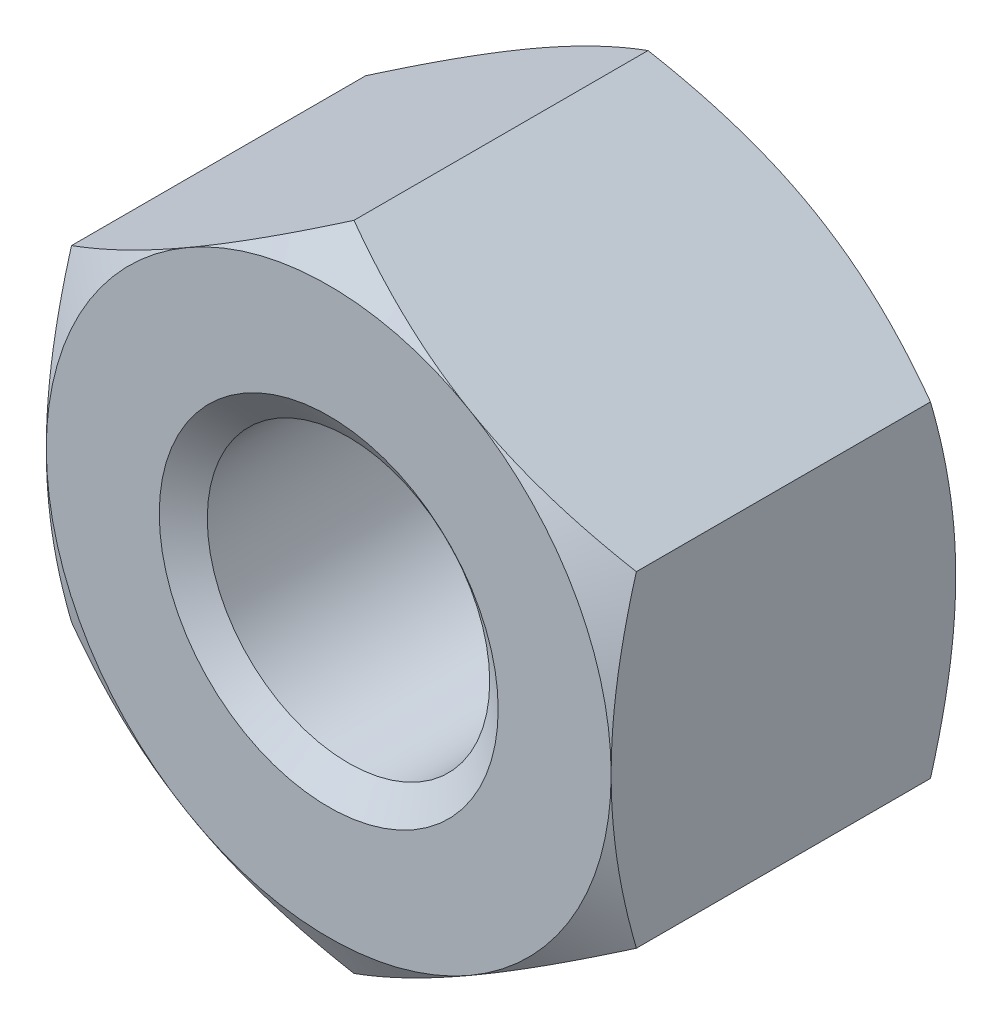
ISO-10303-21;
HEADER;
FILE_DESCRIPTION(('STEP AP214'),'2;1');
FILE_NAME('part.step','',(''),(''),'','','');
FILE_SCHEMA(('AUTOMOTIVE_DESIGN { 1 0 10303 214 1 1 1 1 }'));
ENDSEC;
DATA;
#1=APPLICATION_CONTEXT('core data for automotive mechanical design processes');
#2=APPLICATION_PROTOCOL_DEFINITION('international standard','automotive_design',2000,#1);
#3=PRODUCT_CONTEXT('',#1,'mechanical');
#4=PRODUCT('Part','Part','',(#3));
#5=PRODUCT_RELATED_PRODUCT_CATEGORY('part','',(#4));
#6=PRODUCT_DEFINITION_FORMATION('','',#4);
#7=PRODUCT_DEFINITION_CONTEXT('part definition',#1,'design');
#8=PRODUCT_DEFINITION('design','',#6,#7);
#9=PRODUCT_DEFINITION_SHAPE('','',#8);
#10=(LENGTH_UNIT() NAMED_UNIT(*) SI_UNIT(.MILLI.,.METRE.));
#11=(NAMED_UNIT(*) PLANE_ANGLE_UNIT() SI_UNIT($,.RADIAN.));
#12=(NAMED_UNIT(*) SI_UNIT($,.STERADIAN.) SOLID_ANGLE_UNIT());
#13=UNCERTAINTY_MEASURE_WITH_UNIT(LENGTH_MEASURE(1.E-05),#10,'distance_accuracy_value','');
#14=(GEOMETRIC_REPRESENTATION_CONTEXT(3) GLOBAL_UNCERTAINTY_ASSIGNED_CONTEXT((#13)) GLOBAL_UNIT_ASSIGNED_CONTEXT((#10,
#11,#12)) REPRESENTATION_CONTEXT('',''));
#15=CARTESIAN_POINT('',(0.,0.,0.));
#16=DIRECTION('',(0.,0.,1.));
#17=DIRECTION('',(1.,0.,0.));
#18=AXIS2_PLACEMENT_3D('',#15,#16,#17);
#19=CARTESIAN_POINT('',(0.,0.,-6.1));
#20=DIRECTION('',(0.,0.,1.));
#21=DIRECTION('',(1.,0.,0.));
#22=AXIS2_PLACEMENT_3D('',#19,#20,#21);
#23=CYLINDRICAL_SURFACE('',#22,2.5);
#24=CARTESIAN_POINT('',(0.,0.,-0.350103769104856));
#25=DIRECTION('',(0.,0.,1.));
#26=DIRECTION('',(1.,0.,0.));
#27=AXIS2_PLACEMENT_3D('',#24,#25,#26);
#28=CIRCLE('',#27,2.5);
#29=CARTESIAN_POINT('',(2.5,0.,-0.350103769104856));
#30=VERTEX_POINT('',#29);
#31=EDGE_CURVE('E181',#30,#30,#28,.F.);
#32=ORIENTED_EDGE('',*,*,#31,.F.);
#33=EDGE_LOOP('',(#32));
#34=FACE_BOUND('',#33,.T.);
#35=CARTESIAN_POINT('',(0.,0.,-5.72449623089514));
#36=DIRECTION('',(0.,0.,-1.));
#37=DIRECTION('',(-1.,0.,0.));
#38=AXIS2_PLACEMENT_3D('',#35,#36,#37);
#39=CIRCLE('',#38,2.5);
#40=CARTESIAN_POINT('',(-2.5,0.,-5.72449623089514));
#41=VERTEX_POINT('',#40);
#42=EDGE_CURVE('E46',#41,#41,#39,.F.);
#43=ORIENTED_EDGE('',*,*,#42,.F.);
#44=EDGE_LOOP('',(#43));
#45=FACE_BOUND('',#44,.T.);
#46=ADVANCED_FACE('F41',(#34,#45),#23,.F.);
#47=CARTESIAN_POINT('',(0.,5.77350269189626,-6.1));
#48=DIRECTION('',(-0.500000000000001,0.866025403784438,0.));
#49=DIRECTION('',(-0.866025403784438,-0.500000000000001,0.));
#50=AXIS2_PLACEMENT_3D('',#47,#48,#49);
#51=PLANE('',#50);
#52=DIRECTION('',(0.,0.,1.));
#53=VECTOR('',#52,1.);
#54=CARTESIAN_POINT('',(-5.,2.88675134594813,-6.1));
#55=LINE('',#54,#53);
#56=CARTESIAN_POINT('',(-5.,2.88675134594813,-5.65341801261479));
#57=VERTEX_POINT('',#56);
#58=CARTESIAN_POINT('',(-5.,2.88675134594813,-0.446581987385205));
#59=VERTEX_POINT('',#58);
#60=EDGE_CURVE('E171',#57,#59,#55,.T.);
#61=ORIENTED_EDGE('',*,*,#60,.T.);
#62=CARTESIAN_POINT('',(-5.0002,2.88663587589429,-0.446648656051831));
#63=CARTESIAN_POINT('',(-4.78046540547482,3.01349970319368,-0.373386567637637));
#64=CARTESIAN_POINT('',(-4.55885141554042,3.14144859993849,-0.306751321918093));
#65=CARTESIAN_POINT('',(-4.11178600454649,3.39956193532121,-0.190438991010811));
#66=CARTESIAN_POINT('',(-3.88632664040923,3.52973095989718,-0.140803049915789));
#67=CARTESIAN_POINT('',(-3.43816769477649,3.78847564779798,-0.0635510254186975));
#68=CARTESIAN_POINT('',(-3.21553790689581,3.91701101576052,-0.0354203782834889));
#69=CARTESIAN_POINT('',(-2.88081009815336,4.11026620624322,-0.010194921953684));
#70=CARTESIAN_POINT('',(-2.76915780319494,4.17472868879311,-0.00461345976948354));
#71=CARTESIAN_POINT('',(-2.5457500293262,4.30371322717528,0.000797783248529927));
#72=CARTESIAN_POINT('',(-2.43399455370968,4.36823528110589,0.000627741741796515));
#73=CARTESIAN_POINT('',(-2.12781576914936,4.54500768479195,-0.00775363179203703));
#74=CARTESIAN_POINT('',(-1.93349391403278,4.65719946015293,-0.021829771897252));
#75=CARTESIAN_POINT('',(-1.54613989800229,4.88083840557981,-0.0664652571094318));
#76=CARTESIAN_POINT('',(-1.35310909862843,4.9922847895602,-0.0970398601475098));
#77=CARTESIAN_POINT('',(-0.964974657525144,5.21637431361295,-0.173468493621166));
#78=CARTESIAN_POINT('',(-0.769920001358262,5.32898917185759,-0.219646378878683));
#79=CARTESIAN_POINT('',(-0.38271965464123,5.55253939626498,-0.324451794491938));
#80=CARTESIAN_POINT('',(-0.190569004591912,5.66347762579592,-0.383054703437378));
#81=CARTESIAN_POINT('',(0.000200000000000939,5.7736181619501,-0.446648656051834));
#82=B_SPLINE_CURVE_WITH_KNOTS('',3,(#62,#63,#64,#65,#66,#67,#68,#69,#70,#71,#72,#73,#74,#75,#76,
#77,#78,#79,#80,#81),.UNSPECIFIED.,.F.,.F.,(4,2,2,2,2,2,2,2,2,4),(0.,0.792555841363091,
1.58701660053334,2.36181537487281,2.74884076077326,3.13585419177295,3.8096236259968,
4.4840172390119,5.17336882348929,5.86136694793726),.UNSPECIFIED.);
#83=CARTESIAN_POINT('',(-2.5,4.33012701892219,0.));
#84=VERTEX_POINT('',#83);
#85=EDGE_CURVE('E140',#59,#84,#82,.T.);
#86=ORIENTED_EDGE('',*,*,#85,.T.);
#87=CARTESIAN_POINT('',(0.,5.77350269189626,-0.446581987385207));
#88=VERTEX_POINT('',#87);
#89=EDGE_CURVE('E60',#84,#88,#82,.T.);
#90=ORIENTED_EDGE('',*,*,#89,.T.);
#91=DIRECTION('',(0.,0.,1.));
#92=VECTOR('',#91,1.);
#93=CARTESIAN_POINT('',(0.,5.77350269189626,-6.1));
#94=LINE('',#93,#92);
#95=CARTESIAN_POINT('',(0.,5.77350269189626,-5.65341801261479));
#96=VERTEX_POINT('',#95);
#97=EDGE_CURVE('E156',#96,#88,#94,.T.);
#98=ORIENTED_EDGE('',*,*,#97,.F.);
#99=CARTESIAN_POINT('',(-5.0002,2.88663587589429,-5.65335134394817));
#100=CARTESIAN_POINT('',(-4.78046540547481,3.01349970319368,-5.72661343236236));
#101=CARTESIAN_POINT('',(-4.55885141554042,3.14144859993849,-5.79324867808191));
#102=CARTESIAN_POINT('',(-4.11178600454649,3.39956193532121,-5.90956100898919));
#103=CARTESIAN_POINT('',(-3.88632664040923,3.52973095989718,-5.95919695008421));
#104=CARTESIAN_POINT('',(-3.43816769477649,3.78847564779798,-6.0364489745813));
#105=CARTESIAN_POINT('',(-3.21553790689581,3.91701101576052,-6.06457962171651));
#106=CARTESIAN_POINT('',(-2.88081009815336,4.11026620624322,-6.08980507804632));
#107=CARTESIAN_POINT('',(-2.76915780319494,4.17472868879311,-6.09538654023052));
#108=CARTESIAN_POINT('',(-2.5457500293262,4.30371322717528,-6.10079778324853));
#109=CARTESIAN_POINT('',(-2.43399455370968,4.36823528110589,-6.1006277417418));
#110=CARTESIAN_POINT('',(-2.12781576914936,4.54500768479195,-6.09224636820796));
#111=CARTESIAN_POINT('',(-1.93349391403278,4.65719946015293,-6.07817022810275));
#112=CARTESIAN_POINT('',(-1.54613989800229,4.88083840557981,-6.03353474289057));
#113=CARTESIAN_POINT('',(-1.35310909862843,4.9922847895602,-6.00296013985249));
#114=CARTESIAN_POINT('',(-0.964974657525143,5.21637431361295,-5.92653150637883));
#115=CARTESIAN_POINT('',(-0.769920001358262,5.32898917185759,-5.88035362112132));
#116=CARTESIAN_POINT('',(-0.38271965464123,5.55253939626498,-5.77554820550806));
#117=CARTESIAN_POINT('',(-0.190569004591912,5.66347762579592,-5.71694529656262));
#118=CARTESIAN_POINT('',(0.000200000000000954,5.7736181619501,-5.65335134394817));
#119=B_SPLINE_CURVE_WITH_KNOTS('',3,(#99,#100,#101,#102,#103,#104,#105,#106,#107,#108,#109,#110,
#111,#112,#113,#114,#115,#116,#117,#118),.UNSPECIFIED.,.F.,.F.,(4,2,2,2,2,2,2,2,2,4),(0.,
0.792555841363092,1.58701660053334,2.36181537487281,2.74884076077326,3.13585419177295,
3.8096236259968,4.4840172390119,5.17336882348929,5.86136694793726),.UNSPECIFIED.);
#120=CARTESIAN_POINT('',(-2.5,4.33012701892219,-6.1));
#121=VERTEX_POINT('',#120);
#122=EDGE_CURVE('E174',#121,#96,#119,.T.);
#123=ORIENTED_EDGE('',*,*,#122,.F.);
#124=EDGE_CURVE('E273',#57,#121,#119,.T.);
#125=ORIENTED_EDGE('',*,*,#124,.F.);
#126=EDGE_LOOP('',(#61,#86,#90,#98,#123,#125));
#127=FACE_BOUND('',#126,.T.);
#128=ADVANCED_FACE('F43',(#127),#51,.T.);
#129=CARTESIAN_POINT('',(5.,2.88675134594812,-6.1));
#130=DIRECTION('',(0.500000000000001,0.866025403784438,0.));
#131=DIRECTION('',(-0.866025403784438,0.500000000000001,0.));
#132=AXIS2_PLACEMENT_3D('',#129,#130,#131);
#133=PLANE('',#132);
#134=ORIENTED_EDGE('',*,*,#97,.T.);
#135=CARTESIAN_POINT('',(-0.000199999999998966,5.7736181619501,-0.446648656051833));
#136=CARTESIAN_POINT('',(0.219534594525186,5.64675433465071,-0.373386567637639));
#137=CARTESIAN_POINT('',(0.441148584459582,5.5188054379059,-0.306751321918095));
#138=CARTESIAN_POINT('',(0.888213995453515,5.26069210252318,-0.190438991010812));
#139=CARTESIAN_POINT('',(1.11367335959078,5.13052307794721,-0.14080304991579));
#140=CARTESIAN_POINT('',(1.56183230522351,4.87177839004641,-0.0635510254186981));
#141=CARTESIAN_POINT('',(1.7844620931042,4.74324302208387,-0.0354203782834892));
#142=CARTESIAN_POINT('',(2.11918990184664,4.54998783160116,-0.0101949219536839));
#143=CARTESIAN_POINT('',(2.23084219680506,4.48552534905128,-0.00461345976948323));
#144=CARTESIAN_POINT('',(2.4542499706738,4.35654081066911,0.000797783248530617));
#145=CARTESIAN_POINT('',(2.56600544629032,4.2920187567385,0.000627741741797445));
#146=CARTESIAN_POINT('',(2.87218423085064,4.11524635305244,-0.0077536317920359));
#147=CARTESIAN_POINT('',(3.06650608596722,4.00305457769146,-0.0218297718972512));
#148=CARTESIAN_POINT('',(3.45386010199771,3.77941563226457,-0.066465257109431));
#149=CARTESIAN_POINT('',(3.64689090137157,3.66796924828418,-0.0970398601475084));
#150=CARTESIAN_POINT('',(4.03502534247485,3.44387972423143,-0.173468493621164));
#151=CARTESIAN_POINT('',(4.23007999864174,3.3312648659868,-0.219646378878681));
#152=CARTESIAN_POINT('',(4.61728034535877,3.1077146415794,-0.324451794491935));
#153=CARTESIAN_POINT('',(4.80943099540809,2.99677641204847,-0.383054703437375));
#154=CARTESIAN_POINT('',(5.0002,2.88663587589429,-0.446648656051831));
#155=B_SPLINE_CURVE_WITH_KNOTS('',3,(#135,#136,#137,#138,#139,#140,#141,#142,#143,#144,#145,
#146,#147,#148,#149,#150,#151,#152,#153,#154),.UNSPECIFIED.,.F.,.F.,(4,2,2,2,2,2,2,2,2,4),(0.,
0.792555841363092,1.58701660053334,2.36181537487281,2.74884076077326,3.13585419177295,
3.8096236259968,4.4840172390119,5.17336882348929,5.86136694793726),.UNSPECIFIED.);
#156=CARTESIAN_POINT('',(2.50000000000001,4.33012701892219,0.));
#157=VERTEX_POINT('',#156);
#158=EDGE_CURVE('E150',#88,#157,#155,.T.);
#159=ORIENTED_EDGE('',*,*,#158,.T.);
#160=CARTESIAN_POINT('',(5.,2.88675134594813,-0.446581987385207));
#161=VERTEX_POINT('',#160);
#162=EDGE_CURVE('E67',#157,#161,#155,.T.);
#163=ORIENTED_EDGE('',*,*,#162,.T.);
#164=DIRECTION('',(0.,0.,1.));
#165=VECTOR('',#164,1.);
#166=CARTESIAN_POINT('',(5.,2.88675134594812,-6.1));
#167=LINE('',#166,#165);
#168=CARTESIAN_POINT('',(5.,2.88675134594813,-5.65341801261479));
#169=VERTEX_POINT('',#168);
#170=EDGE_CURVE('E149',#169,#161,#167,.T.);
#171=ORIENTED_EDGE('',*,*,#170,.F.);
#172=CARTESIAN_POINT('',(-0.000199999999998966,5.7736181619501,-5.65335134394817));
#173=CARTESIAN_POINT('',(0.219534594525186,5.64675433465071,-5.72661343236236));
#174=CARTESIAN_POINT('',(0.441148584459582,5.5188054379059,-5.7932486780819));
#175=CARTESIAN_POINT('',(0.888213995453515,5.26069210252318,-5.90956100898919));
#176=CARTESIAN_POINT('',(1.11367335959078,5.13052307794721,-5.95919695008421));
#177=CARTESIAN_POINT('',(1.56183230522351,4.87177839004641,-6.0364489745813));
#178=CARTESIAN_POINT('',(1.7844620931042,4.74324302208387,-6.06457962171651));
#179=CARTESIAN_POINT('',(2.11918990184665,4.54998783160116,-6.08980507804632));
#180=CARTESIAN_POINT('',(2.23084219680506,4.48552534905128,-6.09538654023052));
#181=CARTESIAN_POINT('',(2.4542499706738,4.35654081066911,-6.10079778324853));
#182=CARTESIAN_POINT('',(2.56600544629032,4.2920187567385,-6.1006277417418));
#183=CARTESIAN_POINT('',(2.87218423085064,4.11524635305244,-6.09224636820796));
#184=CARTESIAN_POINT('',(3.06650608596722,4.00305457769146,-6.07817022810275));
#185=CARTESIAN_POINT('',(3.45386010199771,3.77941563226457,-6.03353474289057));
#186=CARTESIAN_POINT('',(3.64689090137157,3.66796924828418,-6.00296013985249));
#187=CARTESIAN_POINT('',(4.03502534247486,3.44387972423143,-5.92653150637884));
#188=CARTESIAN_POINT('',(4.23007999864174,3.3312648659868,-5.88035362112132));
#189=CARTESIAN_POINT('',(4.61728034535877,3.1077146415794,-5.77554820550806));
#190=CARTESIAN_POINT('',(4.80943099540809,2.99677641204846,-5.71694529656262));
#191=CARTESIAN_POINT('',(5.0002,2.88663587589429,-5.65335134394817));
#192=B_SPLINE_CURVE_WITH_KNOTS('',3,(#172,#173,#174,#175,#176,#177,#178,#179,#180,#181,#182,
#183,#184,#185,#186,#187,#188,#189,#190,#191),.UNSPECIFIED.,.F.,.F.,(4,2,2,2,2,2,2,2,2,4),(0.,
0.792555841363092,1.58701660053334,2.36181537487281,2.74884076077326,3.13585419177296,
3.8096236259968,4.4840172390119,5.17336882348929,5.86136694793726),.UNSPECIFIED.);
#193=CARTESIAN_POINT('',(2.50000000000001,4.33012701892219,-6.1));
#194=VERTEX_POINT('',#193);
#195=EDGE_CURVE('E266',#194,#169,#192,.T.);
#196=ORIENTED_EDGE('',*,*,#195,.F.);
#197=EDGE_CURVE('E272',#96,#194,#192,.T.);
#198=ORIENTED_EDGE('',*,*,#197,.F.);
#199=EDGE_LOOP('',(#134,#159,#163,#171,#196,#198));
#200=FACE_BOUND('',#199,.T.);
#201=ADVANCED_FACE('F147',(#200),#133,.T.);
#202=CARTESIAN_POINT('',(5.,2.88675134594812,-6.1));
#203=DIRECTION('',(-1.,0.,0.));
#204=DIRECTION('',(0.,0.,1.));
#205=AXIS2_PLACEMENT_3D('',#202,#203,#204);
#206=PLANE('',#205);
#207=CARTESIAN_POINT('',(5.,-7.65608998744865,-2.39263352655081));
#208=CARTESIAN_POINT('',(5.,-7.43656171400167,-2.28654533817208));
#209=CARTESIAN_POINT('',(5.,-7.21651440170022,-2.18151175461596));
#210=CARTESIAN_POINT('',(5.,-6.77510105921519,-1.97415643363977));
#211=CARTESIAN_POINT('',(5.,-6.55373480873053,-1.87183516574569));
#212=CARTESIAN_POINT('',(5.,-6.10820714710357,-1.66996807853491));
#213=CARTESIAN_POINT('',(5.,-5.88403698971125,-1.57044149281731));
#214=CARTESIAN_POINT('',(5.,-5.43385418074677,-1.37566323278682));
#215=CARTESIAN_POINT('',(5.,-5.20784162594278,-1.28041133564243));
#216=CARTESIAN_POINT('',(5.,-4.75080884782756,-1.09418830918942));
#217=CARTESIAN_POINT('',(5.,-4.51976121099505,-1.0032840909987));
#218=CARTESIAN_POINT('',(5.,-4.054940534221,-0.828595302971952));
#219=CARTESIAN_POINT('',(5.,-3.82116719434025,-0.744811525247654));
#220=CARTESIAN_POINT('',(5.,-3.35100416711889,-0.586614632364621));
#221=CARTESIAN_POINT('',(5.,-3.11462125088188,-0.512181595225273));
#222=CARTESIAN_POINT('',(5.,-2.63849247870024,-0.375104393872378));
#223=CARTESIAN_POINT('',(5.,-2.3987477121033,-0.31245650159695));
#224=CARTESIAN_POINT('',(5.,-1.91574303714497,-0.20198775399487));
#225=CARTESIAN_POINT('',(5.,-1.672482210841,-0.154170846558642));
#226=CARTESIAN_POINT('',(5.,-1.18299359688664,-0.0765955557924027));
#227=CARTESIAN_POINT('',(5.,-0.936765806613283,-0.0468371884284092));
#228=CARTESIAN_POINT('',(5.,-0.567032279323849,-0.0176512015862963));
#229=CARTESIAN_POINT('',(5.,-0.444105297658541,-0.0104963190599468));
#230=CARTESIAN_POINT('',(5.,-0.198053005238566,-0.00139545226904067));
#231=CARTESIAN_POINT('',(5.,-0.0749276970802297,0.000550599639614622));
#232=CARTESIAN_POINT('',(5.,0.171257999892352,-0.000818470345664008));
#233=CARTESIAN_POINT('',(5.,0.294318397227087,-0.00413211431301164));
#234=CARTESIAN_POINT('',(5.,0.54019273078884,-0.0159365972827602));
#235=CARTESIAN_POINT('',(5.,0.663006654263483,-0.0244276975701652));
#236=CARTESIAN_POINT('',(5.,0.960681872881667,-0.0511063802753009));
#237=CARTESIAN_POINT('',(5.,1.1353143627994,-0.0718889676982862));
#238=CARTESIAN_POINT('',(5.,1.48321675799389,-0.122765655722695));
#239=CARTESIAN_POINT('',(5.,1.65648647841236,-0.152860997990034));
#240=CARTESIAN_POINT('',(5.,2.00155426058699,-0.221298792011552));
#241=CARTESIAN_POINT('',(5.,2.17335067370373,-0.259649477486405));
#242=CARTESIAN_POINT('',(5.,2.51518168221054,-0.343428305385011));
#243=CARTESIAN_POINT('',(5.,2.6852163841931,-0.388856016914002));
#244=CARTESIAN_POINT('',(5.,3.02770318928892,-0.486887782054292));
#245=CARTESIAN_POINT('',(5.,3.20011248435312,-0.539640363823942));
#246=CARTESIAN_POINT('',(5.,3.54310870430177,-0.650357787302627));
#247=CARTESIAN_POINT('',(5.,3.71369679659714,-0.70831903390707));
#248=CARTESIAN_POINT('',(5.,4.05236610267973,-0.828256540728474));
#249=CARTESIAN_POINT('',(5.,4.22045602230056,-0.890208365426365));
#250=CARTESIAN_POINT('',(5.,4.55533171687448,-1.01774823413812));
#251=CARTESIAN_POINT('',(5.,4.72211693321414,-1.08333774778777));
#252=CARTESIAN_POINT('',(5.,4.88829623733355,-1.15038625817724));
#253=B_SPLINE_CURVE_WITH_KNOTS('',3,(#207,#208,#209,#210,#211,#212,#213,#214,#215,#216,#217,
#218,#219,#220,#221,#222,#223,#224,#225,#226,#227,#228,#229,#230,#231,#232,#233,#234,#235,#236,
#237,#238,#239,#240,#241,#242,#243,#244,#245,#246,#247,#248,#249,#250,#251,#252),.UNSPECIFIED.,
.F.,.F.,(4,2,2,2,2,2,2,2,2,2,2,2,2,2,2,2,2,2,2,2,2,2,4),(0.,0.731464740665351,1.46305528824909,
2.19883243307486,2.93457117856034,3.67934251246858,4.42419659013362,5.1674358087199,
5.91043951739339,6.65364083834807,7.39684281638516,7.76615414335457,8.13546067426611,
8.50466345177857,8.87388486298453,9.40118542949728,9.92855633110016,10.4564556797854,
10.9843228991235,11.525120280828,12.065547221064,12.6029322754131,13.1405360390026),.UNSPECIFIED.);
#254=CARTESIAN_POINT('',(5.,-2.88675134594814,-0.446581987385207));
#255=VERTEX_POINT('',#254);
#256=CARTESIAN_POINT('',(5.,0.,0.));
#257=VERTEX_POINT('',#256);
#258=EDGE_CURVE('E142',#255,#257,#253,.T.);
#259=ORIENTED_EDGE('',*,*,#258,.F.);
#260=DIRECTION('',(0.,0.,1.));
#261=VECTOR('',#260,1.);
#262=CARTESIAN_POINT('',(5.,-2.88675134594814,-6.1));
#263=LINE('',#262,#261);
#264=CARTESIAN_POINT('',(5.,-2.88675134594814,-5.65341801261479));
#265=VERTEX_POINT('',#264);
#266=EDGE_CURVE('E157',#265,#255,#263,.T.);
#267=ORIENTED_EDGE('',*,*,#266,.F.);
#268=CARTESIAN_POINT('',(5.,-7.65608998744865,-3.70736647344919));
#269=CARTESIAN_POINT('',(5.,-7.43656171400166,-3.81345466182792));
#270=CARTESIAN_POINT('',(5.,-7.21651440170022,-3.91848824538404));
#271=CARTESIAN_POINT('',(5.,-6.77510105921519,-4.12584356636023));
#272=CARTESIAN_POINT('',(5.,-6.55373480873053,-4.22816483425431));
#273=CARTESIAN_POINT('',(5.,-6.10820714710357,-4.43003192146509));
#274=CARTESIAN_POINT('',(5.,-5.88403698971125,-4.52955850718269));
#275=CARTESIAN_POINT('',(5.,-5.43385418074678,-4.72433676721318));
#276=CARTESIAN_POINT('',(5.,-5.20784162594279,-4.81958866435756));
#277=CARTESIAN_POINT('',(5.,-4.75080884782756,-5.00581169081058));
#278=CARTESIAN_POINT('',(5.,-4.51976121099506,-5.0967159090013));
#279=CARTESIAN_POINT('',(5.,-4.054940534221,-5.27140469702805));
#280=CARTESIAN_POINT('',(5.,-3.82116719434025,-5.35518847475234));
#281=CARTESIAN_POINT('',(5.,-3.35100416711889,-5.51338536763538));
#282=CARTESIAN_POINT('',(5.,-3.11462125088188,-5.58781840477473));
#283=CARTESIAN_POINT('',(5.,-2.63849247870024,-5.72489560612762));
#284=CARTESIAN_POINT('',(5.,-2.3987477121033,-5.78754349840305));
#285=CARTESIAN_POINT('',(5.,-1.91574303714497,-5.89801224600513));
#286=CARTESIAN_POINT('',(5.,-1.672482210841,-5.94582915344136));
#287=CARTESIAN_POINT('',(5.,-1.18299359688664,-6.0234044442076));
#288=CARTESIAN_POINT('',(5.,-0.936765806613281,-6.05316281157159));
#289=CARTESIAN_POINT('',(5.,-0.567032279323847,-6.0823487984137));
#290=CARTESIAN_POINT('',(5.,-0.444105297658539,-6.08950368094005));
#291=CARTESIAN_POINT('',(5.,-0.198053005238565,-6.09860454773096));
#292=CARTESIAN_POINT('',(5.,-0.074927697080228,-6.10055059963961));
#293=CARTESIAN_POINT('',(5.,0.171257999892354,-6.09918152965434));
#294=CARTESIAN_POINT('',(5.,0.294318397227089,-6.09586788568699));
#295=CARTESIAN_POINT('',(5.,0.540192730788841,-6.08406340271724));
#296=CARTESIAN_POINT('',(5.,0.663006654263484,-6.07557230242984));
#297=CARTESIAN_POINT('',(5.,0.960681872881666,-6.0488936197247));
#298=CARTESIAN_POINT('',(5.,1.1353143627994,-6.02811103230171));
#299=CARTESIAN_POINT('',(5.,1.48321675799389,-5.97723434427731));
#300=CARTESIAN_POINT('',(5.,1.65648647841236,-5.94713900200997));
#301=CARTESIAN_POINT('',(5.,2.00155426058699,-5.87870120798845));
#302=CARTESIAN_POINT('',(5.,2.17335067370373,-5.84035052251359));
#303=CARTESIAN_POINT('',(5.,2.51518168221054,-5.75657169461499));
#304=CARTESIAN_POINT('',(5.,2.6852163841931,-5.711143983086));
#305=CARTESIAN_POINT('',(5.,3.02770318928891,-5.61311221794571));
#306=CARTESIAN_POINT('',(5.,3.20011248435311,-5.56035963617606));
#307=CARTESIAN_POINT('',(5.,3.54310870430176,-5.44964221269737));
#308=CARTESIAN_POINT('',(5.,3.71369679659714,-5.39168096609293));
#309=CARTESIAN_POINT('',(5.,4.05236610267973,-5.27174345927153));
#310=CARTESIAN_POINT('',(5.,4.22045602230055,-5.20979163457364));
#311=CARTESIAN_POINT('',(5.,4.55533171687448,-5.08225176586188));
#312=CARTESIAN_POINT('',(5.,4.72211693321414,-5.01666225221223));
#313=CARTESIAN_POINT('',(5.,4.88829623733355,-4.94961374182276));
#314=B_SPLINE_CURVE_WITH_KNOTS('',3,(#268,#269,#270,#271,#272,#273,#274,#275,#276,#277,#278,
#279,#280,#281,#282,#283,#284,#285,#286,#287,#288,#289,#290,#291,#292,#293,#294,#295,#296,#297,
#298,#299,#300,#301,#302,#303,#304,#305,#306,#307,#308,#309,#310,#311,#312,#313),.UNSPECIFIED.,
.F.,.F.,(4,2,2,2,2,2,2,2,2,2,2,2,2,2,2,2,2,2,2,2,2,2,4),(0.,0.731464740665352,1.46305528824909,
2.19883243307486,2.93457117856034,3.67934251246858,4.42419659013362,5.1674358087199,
5.91043951739339,6.65364083834807,7.39684281638517,7.76615414335457,8.13546067426611,
8.50466345177857,8.87388486298453,9.40118542949728,9.92855633110016,10.4564556797854,
10.9843228991235,11.525120280828,12.065547221064,12.6029322754131,13.1405360390026),.UNSPECIFIED.);
#315=CARTESIAN_POINT('',(5.,0.,-6.1));
#316=VERTEX_POINT('',#315);
#317=EDGE_CURVE('E280',#265,#316,#314,.T.);
#318=ORIENTED_EDGE('',*,*,#317,.T.);
#319=EDGE_CURVE('E155',#316,#169,#314,.T.);
#320=ORIENTED_EDGE('',*,*,#319,.T.);
#321=ORIENTED_EDGE('',*,*,#170,.T.);
#322=EDGE_CURVE('E132',#257,#161,#253,.T.);
#323=ORIENTED_EDGE('',*,*,#322,.F.);
#324=EDGE_LOOP('',(#259,#267,#318,#320,#321,#323));
#325=FACE_BOUND('',#324,.T.);
#326=ADVANCED_FACE('F153',(#325),#206,.F.);
#327=CARTESIAN_POINT('',(0.,-5.77350269189627,-6.1));
#328=DIRECTION('',(0.5,-0.866025403784438,0.));
#329=DIRECTION('',(0.866025403784438,0.500000000000001,0.));
#330=AXIS2_PLACEMENT_3D('',#327,#328,#329);
#331=PLANE('',#330);
#332=ORIENTED_EDGE('',*,*,#266,.T.);
#333=CARTESIAN_POINT('',(5.0002,-2.8866358758943,-0.446648656051834));
#334=CARTESIAN_POINT('',(4.78046540547481,-3.01349970319369,-0.37338656763764));
#335=CARTESIAN_POINT('',(4.55885141554042,-3.1414485999385,-0.306751321918096));
#336=CARTESIAN_POINT('',(4.11178600454648,-3.39956193532122,-0.190438991010814));
#337=CARTESIAN_POINT('',(3.88632664040922,-3.52973095989719,-0.140803049915792));
#338=CARTESIAN_POINT('',(3.43816769477649,-3.78847564779799,-0.0635510254187013));
#339=CARTESIAN_POINT('',(3.2155379068958,-3.91701101576053,-0.035420378283493));
#340=CARTESIAN_POINT('',(2.88081009815336,-4.11026620624324,-0.0101949219536883));
#341=CARTESIAN_POINT('',(2.76915780319494,-4.17472868879312,-0.00461345976948784));
#342=CARTESIAN_POINT('',(2.5457500293262,-4.30371322717529,0.000797783248525706));
#343=CARTESIAN_POINT('',(2.43399455370968,-4.3682352811059,0.000627741741792379));
#344=CARTESIAN_POINT('',(2.12781576914936,-4.54500768479195,-0.00775363179204149));
#345=CARTESIAN_POINT('',(1.93349391403278,-4.65719946015294,-0.0218297718972572));
#346=CARTESIAN_POINT('',(1.54613989800229,-4.88083840557983,-0.0664652571094375));
#347=CARTESIAN_POINT('',(1.35310909862843,-4.99228478956021,-0.097039860147515));
#348=CARTESIAN_POINT('',(0.964974657525142,-5.21637431361296,-0.173468493621171));
#349=CARTESIAN_POINT('',(0.769920001358261,-5.3289891718576,-0.219646378878688));
#350=CARTESIAN_POINT('',(0.38271965464123,-5.55253939626499,-0.324451794491943));
#351=CARTESIAN_POINT('',(0.190569004591913,-5.66347762579593,-0.383054703437384));
#352=CARTESIAN_POINT('',(-0.00020000000000063,-5.77361816195011,-0.446648656051839));
#353=B_SPLINE_CURVE_WITH_KNOTS('',3,(#333,#334,#335,#336,#337,#338,#339,#340,#341,#342,#343,
#344,#345,#346,#347,#348,#349,#350,#351,#352),.UNSPECIFIED.,.F.,.F.,(4,2,2,2,2,2,2,2,2,4),(0.,
0.792555841363093,1.58701660053334,2.36181537487281,2.74884076077326,3.13585419177296,
3.8096236259968,4.4840172390119,5.17336882348929,5.86136694793726),.UNSPECIFIED.);
#354=CARTESIAN_POINT('',(2.5,-4.33012701892219,0.));
#355=VERTEX_POINT('',#354);
#356=EDGE_CURVE('E378',#255,#355,#353,.T.);
#357=ORIENTED_EDGE('',*,*,#356,.T.);
#358=CARTESIAN_POINT('',(0.,-5.77350269189626,-0.446581987385207));
#359=VERTEX_POINT('',#358);
#360=EDGE_CURVE('E234',#355,#359,#353,.T.);
#361=ORIENTED_EDGE('',*,*,#360,.T.);
#362=DIRECTION('',(0.,0.,1.));
#363=VECTOR('',#362,1.);
#364=CARTESIAN_POINT('',(0.,-5.77350269189627,-6.1));
#365=LINE('',#364,#363);
#366=CARTESIAN_POINT('',(0.,-5.77350269189626,-5.65341801261479));
#367=VERTEX_POINT('',#366);
#368=EDGE_CURVE('E162',#367,#359,#365,.T.);
#369=ORIENTED_EDGE('',*,*,#368,.F.);
#370=CARTESIAN_POINT('',(5.0002,-2.8866358758943,-5.65335134394816));
#371=CARTESIAN_POINT('',(4.78046540547481,-3.01349970319369,-5.72661343236236));
#372=CARTESIAN_POINT('',(4.55885141554042,-3.1414485999385,-5.7932486780819));
#373=CARTESIAN_POINT('',(4.11178600454648,-3.39956193532122,-5.90956100898919));
#374=CARTESIAN_POINT('',(3.88632664040922,-3.52973095989719,-5.95919695008421));
#375=CARTESIAN_POINT('',(3.43816769477649,-3.78847564779799,-6.0364489745813));
#376=CARTESIAN_POINT('',(3.2155379068958,-3.91701101576053,-6.06457962171651));
#377=CARTESIAN_POINT('',(2.88081009815336,-4.11026620624324,-6.08980507804631));
#378=CARTESIAN_POINT('',(2.76915780319494,-4.17472868879312,-6.09538654023051));
#379=CARTESIAN_POINT('',(2.5457500293262,-4.30371322717529,-6.10079778324852));
#380=CARTESIAN_POINT('',(2.43399455370968,-4.3682352811059,-6.10062774174179));
#381=CARTESIAN_POINT('',(2.12781576914936,-4.54500768479195,-6.09224636820796));
#382=CARTESIAN_POINT('',(1.93349391403278,-4.65719946015294,-6.07817022810274));
#383=CARTESIAN_POINT('',(1.54613989800229,-4.88083840557983,-6.03353474289056));
#384=CARTESIAN_POINT('',(1.35310909862843,-4.99228478956021,-6.00296013985248));
#385=CARTESIAN_POINT('',(0.964974657525143,-5.21637431361296,-5.92653150637883));
#386=CARTESIAN_POINT('',(0.769920001358261,-5.3289891718576,-5.88035362112131));
#387=CARTESIAN_POINT('',(0.38271965464123,-5.55253939626499,-5.77554820550806));
#388=CARTESIAN_POINT('',(0.190569004591913,-5.66347762579593,-5.71694529656262));
#389=CARTESIAN_POINT('',(-0.000200000000000624,-5.77361816195011,-5.65335134394816));
#390=B_SPLINE_CURVE_WITH_KNOTS('',3,(#370,#371,#372,#373,#374,#375,#376,#377,#378,#379,#380,
#381,#382,#383,#384,#385,#386,#387,#388,#389),.UNSPECIFIED.,.F.,.F.,(4,2,2,2,2,2,2,2,2,4),(0.,
0.792555841363093,1.58701660053334,2.36181537487281,2.74884076077326,3.13585419177296,
3.8096236259968,4.4840172390119,5.17336882348929,5.86136694793726),.UNSPECIFIED.);
#391=CARTESIAN_POINT('',(2.5,-4.33012701892219,-6.1));
#392=VERTEX_POINT('',#391);
#393=EDGE_CURVE('E287',#392,#367,#390,.T.);
#394=ORIENTED_EDGE('',*,*,#393,.F.);
#395=EDGE_CURVE('E286',#265,#392,#390,.T.);
#396=ORIENTED_EDGE('',*,*,#395,.F.);
#397=EDGE_LOOP('',(#332,#357,#361,#369,#394,#396));
#398=FACE_BOUND('',#397,.T.);
#399=ADVANCED_FACE('F299',(#398),#331,.T.);
#400=CARTESIAN_POINT('',(-5.,-2.88675134594813,-6.1));
#401=DIRECTION('',(-0.500000000000001,-0.866025403784438,0.));
#402=DIRECTION('',(0.866025403784438,-0.500000000000001,0.));
#403=AXIS2_PLACEMENT_3D('',#400,#401,#402);
#404=PLANE('',#403);
#405=ORIENTED_EDGE('',*,*,#368,.T.);
#406=CARTESIAN_POINT('',(0.000199999999999249,-5.77361816195011,-0.446648656051839));
#407=CARTESIAN_POINT('',(-0.219534594525186,-5.64675433465072,-0.373386567637644));
#408=CARTESIAN_POINT('',(-0.441148584459582,-5.51880543790591,-0.3067513219181));
#409=CARTESIAN_POINT('',(-0.888213995453516,-5.26069210252319,-0.190438991010817));
#410=CARTESIAN_POINT('',(-1.11367335959078,-5.13052307794722,-0.140803049915795));
#411=CARTESIAN_POINT('',(-1.56183230522351,-4.87177839004642,-0.063551025418703));
#412=CARTESIAN_POINT('',(-1.7844620931042,-4.74324302208388,-0.0354203782834935));
#413=CARTESIAN_POINT('',(-2.11918990184665,-4.54998783160117,-0.0101949219536883));
#414=CARTESIAN_POINT('',(-2.23084219680507,-4.48552534905128,-0.00461345976948777));
#415=CARTESIAN_POINT('',(-2.4542499706738,-4.35654081066911,0.000797783248525878));
#416=CARTESIAN_POINT('',(-2.56600544629032,-4.2920187567385,0.000627741741792682));
#417=CARTESIAN_POINT('',(-2.87218423085065,-4.11524635305245,-0.00775363179204064));
#418=CARTESIAN_POINT('',(-3.06650608596722,-4.00305457769147,-0.0218297718972558));
#419=CARTESIAN_POINT('',(-3.45386010199771,-3.77941563226458,-0.066465257109435));
#420=CARTESIAN_POINT('',(-3.64689090137157,-3.66796924828419,-0.097039860147512));
#421=CARTESIAN_POINT('',(-4.03502534247486,-3.44387972423144,-0.173468493621168));
#422=CARTESIAN_POINT('',(-4.23007999864174,-3.3312648659868,-0.219646378878684));
#423=CARTESIAN_POINT('',(-4.61728034535877,-3.10771464157941,-0.324451794491939));
#424=CARTESIAN_POINT('',(-4.80943099540809,-2.99677641204847,-0.383054703437379));
#425=CARTESIAN_POINT('',(-5.0002,-2.8866358758943,-0.446648656051833));
#426=B_SPLINE_CURVE_WITH_KNOTS('',3,(#406,#407,#408,#409,#410,#411,#412,#413,#414,#415,#416,
#417,#418,#419,#420,#421,#422,#423,#424,#425),.UNSPECIFIED.,.F.,.F.,(4,2,2,2,2,2,2,2,2,4),(0.,
0.792555841363093,1.58701660053334,2.36181537487281,2.74884076077326,3.13585419177296,
3.8096236259968,4.4840172390119,5.17336882348929,5.86136694793726),.UNSPECIFIED.);
#427=CARTESIAN_POINT('',(-2.50000000000001,-4.33012701892219,0.));
#428=VERTEX_POINT('',#427);
#429=EDGE_CURVE('E375',#359,#428,#426,.T.);
#430=ORIENTED_EDGE('',*,*,#429,.T.);
#431=CARTESIAN_POINT('',(-5.,-2.88675134594813,-0.446581987385207));
#432=VERTEX_POINT('',#431);
#433=EDGE_CURVE('E207',#428,#432,#426,.T.);
#434=ORIENTED_EDGE('',*,*,#433,.T.);
#435=DIRECTION('',(0.,0.,1.));
#436=VECTOR('',#435,1.);
#437=CARTESIAN_POINT('',(-5.,-2.88675134594813,-6.1));
#438=LINE('',#437,#436);
#439=CARTESIAN_POINT('',(-5.,-2.88675134594813,-5.65341801261479));
#440=VERTEX_POINT('',#439);
#441=EDGE_CURVE('E168',#440,#432,#438,.T.);
#442=ORIENTED_EDGE('',*,*,#441,.F.);
#443=CARTESIAN_POINT('',(0.000199999999999249,-5.77361816195011,-5.65335134394816));
#444=CARTESIAN_POINT('',(-0.219534594525186,-5.64675433465072,-5.72661343236236));
#445=CARTESIAN_POINT('',(-0.441148584459582,-5.51880543790591,-5.7932486780819));
#446=CARTESIAN_POINT('',(-0.888213995453515,-5.26069210252319,-5.90956100898918));
#447=CARTESIAN_POINT('',(-1.11367335959078,-5.13052307794722,-5.9591969500842));
#448=CARTESIAN_POINT('',(-1.56183230522351,-4.87177839004642,-6.0364489745813));
#449=CARTESIAN_POINT('',(-1.7844620931042,-4.74324302208388,-6.06457962171651));
#450=CARTESIAN_POINT('',(-2.11918990184665,-4.54998783160117,-6.08980507804631));
#451=CARTESIAN_POINT('',(-2.23084219680507,-4.48552534905128,-6.09538654023051));
#452=CARTESIAN_POINT('',(-2.4542499706738,-4.35654081066911,-6.10079778324852));
#453=CARTESIAN_POINT('',(-2.56600544629032,-4.2920187567385,-6.10062774174179));
#454=CARTESIAN_POINT('',(-2.87218423085065,-4.11524635305245,-6.09224636820796));
#455=CARTESIAN_POINT('',(-3.06650608596722,-4.00305457769147,-6.07817022810274));
#456=CARTESIAN_POINT('',(-3.45386010199771,-3.77941563226458,-6.03353474289057));
#457=CARTESIAN_POINT('',(-3.64689090137157,-3.66796924828419,-6.00296013985249));
#458=CARTESIAN_POINT('',(-4.03502534247486,-3.44387972423144,-5.92653150637883));
#459=CARTESIAN_POINT('',(-4.23007999864174,-3.3312648659868,-5.88035362112132));
#460=CARTESIAN_POINT('',(-4.61728034535877,-3.10771464157941,-5.77554820550806));
#461=CARTESIAN_POINT('',(-4.80943099540809,-2.99677641204847,-5.71694529656262));
#462=CARTESIAN_POINT('',(-5.0002,-2.8866358758943,-5.65335134394817));
#463=B_SPLINE_CURVE_WITH_KNOTS('',3,(#443,#444,#445,#446,#447,#448,#449,#450,#451,#452,#453,
#454,#455,#456,#457,#458,#459,#460,#461,#462),.UNSPECIFIED.,.F.,.F.,(4,2,2,2,2,2,2,2,2,4),(0.,
0.792555841363093,1.58701660053334,2.36181537487281,2.74884076077326,3.13585419177296,
3.8096236259968,4.4840172390119,5.17336882348929,5.86136694793726),.UNSPECIFIED.);
#464=CARTESIAN_POINT('',(-2.50000000000001,-4.33012701892219,-6.1));
#465=VERTEX_POINT('',#464);
#466=EDGE_CURVE('E294',#465,#440,#463,.T.);
#467=ORIENTED_EDGE('',*,*,#466,.F.);
#468=EDGE_CURVE('E293',#367,#465,#463,.T.);
#469=ORIENTED_EDGE('',*,*,#468,.F.);
#470=EDGE_LOOP('',(#405,#430,#434,#442,#467,#469));
#471=FACE_BOUND('',#470,.T.);
#472=ADVANCED_FACE('F302',(#471),#404,.T.);
#473=CARTESIAN_POINT('',(-5.,2.88675134594813,-6.1));
#474=DIRECTION('',(-1.,0.,0.));
#475=DIRECTION('',(0.,0.,1.));
#476=AXIS2_PLACEMENT_3D('',#473,#474,#475);
#477=PLANE('',#476);
#478=ORIENTED_EDGE('',*,*,#441,.T.);
#479=CARTESIAN_POINT('',(-5.,-7.65608998744865,-2.3926335265508));
#480=CARTESIAN_POINT('',(-5.,-7.43656171400166,-2.28654533817208));
#481=CARTESIAN_POINT('',(-5.,-7.21651440170022,-2.18151175461596));
#482=CARTESIAN_POINT('',(-5.,-6.77510105921519,-1.97415643363977));
#483=CARTESIAN_POINT('',(-5.,-6.55373480873053,-1.87183516574569));
#484=CARTESIAN_POINT('',(-5.,-6.10820714710357,-1.66996807853491));
#485=CARTESIAN_POINT('',(-5.,-5.88403698971124,-1.57044149281731));
#486=CARTESIAN_POINT('',(-5.,-5.43385418074677,-1.37566323278682));
#487=CARTESIAN_POINT('',(-5.,-5.20784162594278,-1.28041133564243));
#488=CARTESIAN_POINT('',(-5.,-4.75080884782756,-1.09418830918942));
#489=CARTESIAN_POINT('',(-5.,-4.51976121099505,-1.0032840909987));
#490=CARTESIAN_POINT('',(-5.,-4.054940534221,-0.828595302971951));
#491=CARTESIAN_POINT('',(-5.,-3.82116719434025,-0.744811525247654));
#492=CARTESIAN_POINT('',(-5.,-3.35100416711889,-0.586614632364621));
#493=CARTESIAN_POINT('',(-5.,-3.11462125088188,-0.512181595225272));
#494=CARTESIAN_POINT('',(-5.,-2.63849247870023,-0.375104393872378));
#495=CARTESIAN_POINT('',(-5.,-2.3987477121033,-0.31245650159695));
#496=CARTESIAN_POINT('',(-5.,-1.91574303714497,-0.20198775399487));
#497=CARTESIAN_POINT('',(-5.,-1.672482210841,-0.154170846558642));
#498=CARTESIAN_POINT('',(-5.,-1.18299359688664,-0.0765955557924027));
#499=CARTESIAN_POINT('',(-5.,-0.93676580661328,-0.0468371884284092));
#500=CARTESIAN_POINT('',(-5.,-0.567032279323847,-0.0176512015862963));
#501=CARTESIAN_POINT('',(-5.,-0.444105297658538,-0.0104963190599468));
#502=CARTESIAN_POINT('',(-5.,-0.198053005238564,-0.00139545226904067));
#503=CARTESIAN_POINT('',(-5.,-0.0749276970802274,0.000550599639614625));
#504=CARTESIAN_POINT('',(-5.,0.171257999892354,-0.000818470345664012));
#505=CARTESIAN_POINT('',(-5.,0.294318397227089,-0.00413211431301166));
#506=CARTESIAN_POINT('',(-5.,0.540192730788842,-0.0159365972827601));
#507=CARTESIAN_POINT('',(-5.,0.663006654263485,-0.0244276975701651));
#508=CARTESIAN_POINT('',(-5.,0.960681872881668,-0.051106380275301));
#509=CARTESIAN_POINT('',(-5.,1.1353143627994,-0.0718889676982866));
#510=CARTESIAN_POINT('',(-5.,1.48321675799389,-0.122765655722696));
#511=CARTESIAN_POINT('',(-5.,1.65648647841236,-0.152860997990035));
#512=CARTESIAN_POINT('',(-5.,2.00155426058699,-0.221298792011552));
#513=CARTESIAN_POINT('',(-5.,2.17335067370373,-0.259649477486405));
#514=CARTESIAN_POINT('',(-5.,2.51518168221054,-0.343428305385012));
#515=CARTESIAN_POINT('',(-5.,2.6852163841931,-0.388856016914002));
#516=CARTESIAN_POINT('',(-5.,3.02770318928892,-0.486887782054293));
#517=CARTESIAN_POINT('',(-5.,3.20011248435312,-0.539640363823943));
#518=CARTESIAN_POINT('',(-5.,3.54310870430177,-0.650357787302626));
#519=CARTESIAN_POINT('',(-5.,3.71369679659714,-0.70831903390707));
#520=CARTESIAN_POINT('',(-5.,4.05236610267974,-0.828256540728474));
#521=CARTESIAN_POINT('',(-5.,4.22045602230056,-0.890208365426365));
#522=CARTESIAN_POINT('',(-5.,4.55533171687448,-1.01774823413812));
#523=CARTESIAN_POINT('',(-5.,4.72211693321414,-1.08333774778777));
#524=CARTESIAN_POINT('',(-5.,4.88829623733355,-1.15038625817724));
#525=B_SPLINE_CURVE_WITH_KNOTS('',3,(#479,#480,#481,#482,#483,#484,#485,#486,#487,#488,#489,
#490,#491,#492,#493,#494,#495,#496,#497,#498,#499,#500,#501,#502,#503,#504,#505,#506,#507,#508,
#509,#510,#511,#512,#513,#514,#515,#516,#517,#518,#519,#520,#521,#522,#523,#524),.UNSPECIFIED.,
.F.,.F.,(4,2,2,2,2,2,2,2,2,2,2,2,2,2,2,2,2,2,2,2,2,2,4),(0.,0.731464740665352,1.46305528824909,
2.19883243307486,2.93457117856034,3.67934251246858,4.42419659013362,5.1674358087199,
5.91043951739339,6.65364083834807,7.39684281638516,7.76615414335457,8.13546067426611,
8.50466345177857,8.87388486298453,9.40118542949728,9.92855633110016,10.4564556797854,
10.9843228991235,11.525120280828,12.065547221064,12.6029322754131,13.1405360390026),.UNSPECIFIED.);
#526=CARTESIAN_POINT('',(-5.,0.,0.));
#527=VERTEX_POINT('',#526);
#528=EDGE_CURVE('E206',#432,#527,#525,.T.);
#529=ORIENTED_EDGE('',*,*,#528,.T.);
#530=EDGE_CURVE('E198',#527,#59,#525,.T.);
#531=ORIENTED_EDGE('',*,*,#530,.T.);
#532=ORIENTED_EDGE('',*,*,#60,.F.);
#533=CARTESIAN_POINT('',(-5.,-7.65608998744865,-3.70736647344919));
#534=CARTESIAN_POINT('',(-5.,-7.43656171400166,-3.81345466182792));
#535=CARTESIAN_POINT('',(-5.,-7.21651440170022,-3.91848824538404));
#536=CARTESIAN_POINT('',(-5.,-6.77510105921519,-4.12584356636023));
#537=CARTESIAN_POINT('',(-5.,-6.55373480873053,-4.22816483425431));
#538=CARTESIAN_POINT('',(-5.,-6.10820714710357,-4.43003192146509));
#539=CARTESIAN_POINT('',(-5.,-5.88403698971124,-4.52955850718269));
#540=CARTESIAN_POINT('',(-5.,-5.43385418074677,-4.72433676721318));
#541=CARTESIAN_POINT('',(-5.,-5.20784162594278,-4.81958866435757));
#542=CARTESIAN_POINT('',(-5.,-4.75080884782756,-5.00581169081058));
#543=CARTESIAN_POINT('',(-5.,-4.51976121099505,-5.0967159090013));
#544=CARTESIAN_POINT('',(-5.,-4.054940534221,-5.27140469702805));
#545=CARTESIAN_POINT('',(-5.,-3.82116719434025,-5.35518847475235));
#546=CARTESIAN_POINT('',(-5.,-3.35100416711889,-5.51338536763538));
#547=CARTESIAN_POINT('',(-5.,-3.11462125088188,-5.58781840477473));
#548=CARTESIAN_POINT('',(-5.,-2.63849247870023,-5.72489560612762));
#549=CARTESIAN_POINT('',(-5.,-2.3987477121033,-5.78754349840305));
#550=CARTESIAN_POINT('',(-5.,-1.91574303714497,-5.89801224600513));
#551=CARTESIAN_POINT('',(-5.,-1.672482210841,-5.94582915344136));
#552=CARTESIAN_POINT('',(-5.,-1.18299359688664,-6.0234044442076));
#553=CARTESIAN_POINT('',(-5.,-0.936765806613282,-6.05316281157159));
#554=CARTESIAN_POINT('',(-5.,-0.567032279323848,-6.0823487984137));
#555=CARTESIAN_POINT('',(-5.,-0.44410529765854,-6.08950368094005));
#556=CARTESIAN_POINT('',(-5.,-0.198053005238565,-6.09860454773096));
#557=CARTESIAN_POINT('',(-5.,-0.074927697080228,-6.10055059963961));
#558=CARTESIAN_POINT('',(-5.,0.171257999892354,-6.09918152965434));
#559=CARTESIAN_POINT('',(-5.,0.29431839722709,-6.09586788568699));
#560=CARTESIAN_POINT('',(-5.,0.540192730788842,-6.08406340271724));
#561=CARTESIAN_POINT('',(-5.,0.663006654263485,-6.07557230242984));
#562=CARTESIAN_POINT('',(-5.,0.960681872881669,-6.0488936197247));
#563=CARTESIAN_POINT('',(-5.,1.1353143627994,-6.02811103230171));
#564=CARTESIAN_POINT('',(-5.,1.48321675799389,-5.9772343442773));
#565=CARTESIAN_POINT('',(-5.,1.65648647841236,-5.94713900200996));
#566=CARTESIAN_POINT('',(-5.,2.00155426058699,-5.87870120798845));
#567=CARTESIAN_POINT('',(-5.,2.17335067370373,-5.84035052251359));
#568=CARTESIAN_POINT('',(-5.,2.51518168221054,-5.75657169461499));
#569=CARTESIAN_POINT('',(-5.,2.68521638419311,-5.711143983086));
#570=CARTESIAN_POINT('',(-5.,3.02770318928892,-5.61311221794571));
#571=CARTESIAN_POINT('',(-5.,3.20011248435312,-5.56035963617606));
#572=CARTESIAN_POINT('',(-5.,3.54310870430177,-5.44964221269737));
#573=CARTESIAN_POINT('',(-5.,3.71369679659714,-5.39168096609293));
#574=CARTESIAN_POINT('',(-5.,4.05236610267973,-5.27174345927152));
#575=CARTESIAN_POINT('',(-5.,4.22045602230056,-5.20979163457363));
#576=CARTESIAN_POINT('',(-5.,4.55533171687448,-5.08225176586188));
#577=CARTESIAN_POINT('',(-5.,4.72211693321414,-5.01666225221223));
#578=CARTESIAN_POINT('',(-5.,4.88829623733355,-4.94961374182276));
#579=B_SPLINE_CURVE_WITH_KNOTS('',3,(#533,#534,#535,#536,#537,#538,#539,#540,#541,#542,#543,
#544,#545,#546,#547,#548,#549,#550,#551,#552,#553,#554,#555,#556,#557,#558,#559,#560,#561,#562,
#563,#564,#565,#566,#567,#568,#569,#570,#571,#572,#573,#574,#575,#576,#577,#578),.UNSPECIFIED.,
.F.,.F.,(4,2,2,2,2,2,2,2,2,2,2,2,2,2,2,2,2,2,2,2,2,2,4),(0.,0.731464740665352,1.46305528824909,
2.19883243307486,2.93457117856034,3.67934251246858,4.42419659013362,5.1674358087199,
5.91043951739339,6.65364083834806,7.39684281638516,7.76615414335457,8.13546067426611,
8.50466345177856,8.87388486298453,9.40118542949728,9.92855633110016,10.4564556797854,
10.9843228991235,11.525120280828,12.065547221064,12.6029322754131,13.1405360390026),.UNSPECIFIED.);
#580=CARTESIAN_POINT('',(-5.,0.,-6.1));
#581=VERTEX_POINT('',#580);
#582=EDGE_CURVE('E346',#581,#57,#579,.T.);
#583=ORIENTED_EDGE('',*,*,#582,.F.);
#584=EDGE_CURVE('E349',#440,#581,#579,.T.);
#585=ORIENTED_EDGE('',*,*,#584,.F.);
#586=EDGE_LOOP('',(#478,#529,#531,#532,#583,#585));
#587=FACE_BOUND('',#586,.T.);
#588=ADVANCED_FACE('F214',(#587),#477,.T.);
#589=CARTESIAN_POINT('',(0.,5.77350269189626,0.));
#590=DIRECTION('',(0.,0.,-1.));
#591=DIRECTION('',(-1.,0.,0.));
#592=AXIS2_PLACEMENT_3D('',#589,#590,#591);
#593=PLANE('',#592);
#594=CARTESIAN_POINT('',(0.,0.,0.));
#595=DIRECTION('',(0.,0.,1.));
#596=DIRECTION('',(1.,0.,0.));
#597=AXIS2_PLACEMENT_3D('',#594,#595,#596);
#598=CIRCLE('',#597,3.);
#599=CARTESIAN_POINT('',(3.,0.,0.));
#600=VERTEX_POINT('',#599);
#601=EDGE_CURVE('E183',#600,#600,#598,.T.);
#602=ORIENTED_EDGE('',*,*,#601,.F.);
#603=EDGE_LOOP('',(#602));
#604=FACE_BOUND('',#603,.T.);
#605=CARTESIAN_POINT('',(0.,0.,0.));
#606=DIRECTION('',(0.,0.,-1.));
#607=DIRECTION('',(-1.,0.,0.));
#608=AXIS2_PLACEMENT_3D('',#605,#606,#607);
#609=CIRCLE('',#608,5.);
#610=EDGE_CURVE('E11',#527,#84,#609,.T.);
#611=ORIENTED_EDGE('',*,*,#610,.F.);
#612=EDGE_CURVE('E53',#428,#527,#609,.T.);
#613=ORIENTED_EDGE('',*,*,#612,.F.);
#614=EDGE_CURVE('E180',#355,#428,#609,.T.);
#615=ORIENTED_EDGE('',*,*,#614,.F.);
#616=EDGE_CURVE('E382',#257,#355,#609,.T.);
#617=ORIENTED_EDGE('',*,*,#616,.F.);
#618=CARTESIAN_POINT('',(0.,0.,0.));
#619=DIRECTION('',(0.,0.,1.));
#620=DIRECTION('',(1.,0.,0.));
#621=AXIS2_PLACEMENT_3D('',#618,#619,#620);
#622=CIRCLE('',#621,5.);
#623=EDGE_CURVE('E135',#257,#157,#622,.T.);
#624=ORIENTED_EDGE('',*,*,#623,.T.);
#625=EDGE_CURVE('E51',#84,#157,#609,.T.);
#626=ORIENTED_EDGE('',*,*,#625,.F.);
#627=EDGE_LOOP('',(#611,#613,#615,#617,#624,#626));
#628=FACE_BOUND('',#627,.T.);
#629=ADVANCED_FACE('F262',(#604,#628),#593,.F.);
#630=CARTESIAN_POINT('',(0.,5.77350269189626,-6.1));
#631=DIRECTION('',(0.,0.,-1.));
#632=DIRECTION('',(-1.,0.,0.));
#633=AXIS2_PLACEMENT_3D('',#630,#631,#632);
#634=PLANE('',#633);
#635=CARTESIAN_POINT('',(0.,0.,-6.1));
#636=DIRECTION('',(0.,0.,-1.));
#637=DIRECTION('',(-1.,0.,0.));
#638=AXIS2_PLACEMENT_3D('',#635,#636,#637);
#639=CIRCLE('',#638,3.);
#640=CARTESIAN_POINT('',(-3.,0.,-6.1));
#641=VERTEX_POINT('',#640);
#642=EDGE_CURVE('E184',#641,#641,#639,.F.);
#643=ORIENTED_EDGE('',*,*,#642,.T.);
#644=EDGE_LOOP('',(#643));
#645=FACE_BOUND('',#644,.T.);
#646=CARTESIAN_POINT('',(0.,0.,-6.1));
#647=DIRECTION('',(0.,0.,-1.));
#648=DIRECTION('',(-1.,0.,0.));
#649=AXIS2_PLACEMENT_3D('',#646,#647,#648);
#650=CIRCLE('',#649,5.);
#651=EDGE_CURVE('E177',#581,#465,#650,.F.);
#652=ORIENTED_EDGE('',*,*,#651,.F.);
#653=EDGE_CURVE('E159',#121,#581,#650,.F.);
#654=ORIENTED_EDGE('',*,*,#653,.F.);
#655=EDGE_CURVE('E176',#194,#121,#650,.F.);
#656=ORIENTED_EDGE('',*,*,#655,.F.);
#657=CARTESIAN_POINT('',(0.,0.,-6.1));
#658=DIRECTION('',(0.,0.,1.));
#659=DIRECTION('',(1.,0.,0.));
#660=AXIS2_PLACEMENT_3D('',#657,#658,#659);
#661=CIRCLE('',#660,5.);
#662=EDGE_CURVE('E257',#316,#194,#661,.T.);
#663=ORIENTED_EDGE('',*,*,#662,.F.);
#664=EDGE_CURVE('E362',#392,#316,#650,.F.);
#665=ORIENTED_EDGE('',*,*,#664,.F.);
#666=EDGE_CURVE('E341',#465,#392,#650,.F.);
#667=ORIENTED_EDGE('',*,*,#666,.F.);
#668=EDGE_LOOP('',(#652,#654,#656,#663,#665,#667));
#669=FACE_BOUND('',#668,.T.);
#670=ADVANCED_FACE('F321',(#645,#669),#634,.T.);
#671=CARTESIAN_POINT('',(0.,0.,-6.1));
#672=DIRECTION('',(0.,0.,1.));
#673=DIRECTION('',(1.,0.,0.));
#674=AXIS2_PLACEMENT_3D('',#671,#672,#673);
#675=CONICAL_SURFACE('',#674,5.,1.0471975511966);
#676=ORIENTED_EDGE('',*,*,#124,.T.);
#677=ORIENTED_EDGE('',*,*,#653,.T.);
#678=ORIENTED_EDGE('',*,*,#582,.T.);
#679=EDGE_LOOP('',(#676,#677,#678));
#680=FACE_BOUND('',#679,.T.);
#681=ADVANCED_FACE('F323',(#680),#675,.T.);
#682=ORIENTED_EDGE('',*,*,#122,.T.);
#683=ORIENTED_EDGE('',*,*,#197,.T.);
#684=ORIENTED_EDGE('',*,*,#655,.T.);
#685=EDGE_LOOP('',(#682,#683,#684));
#686=FACE_BOUND('',#685,.T.);
#687=ADVANCED_FACE('F328',(#686),#675,.T.);
#688=ORIENTED_EDGE('',*,*,#195,.T.);
#689=ORIENTED_EDGE('',*,*,#319,.F.);
#690=ORIENTED_EDGE('',*,*,#662,.T.);
#691=EDGE_LOOP('',(#688,#689,#690));
#692=FACE_BOUND('',#691,.T.);
#693=ADVANCED_FACE('F385',(#692),#675,.T.);
#694=ORIENTED_EDGE('',*,*,#395,.T.);
#695=ORIENTED_EDGE('',*,*,#664,.T.);
#696=ORIENTED_EDGE('',*,*,#317,.F.);
#697=EDGE_LOOP('',(#694,#695,#696));
#698=FACE_BOUND('',#697,.T.);
#699=ADVANCED_FACE('F331',(#698),#675,.T.);
#700=ORIENTED_EDGE('',*,*,#393,.T.);
#701=ORIENTED_EDGE('',*,*,#468,.T.);
#702=ORIENTED_EDGE('',*,*,#666,.T.);
#703=EDGE_LOOP('',(#700,#701,#702));
#704=FACE_BOUND('',#703,.T.);
#705=ADVANCED_FACE('F330',(#704),#675,.T.);
#706=ORIENTED_EDGE('',*,*,#466,.T.);
#707=ORIENTED_EDGE('',*,*,#584,.T.);
#708=ORIENTED_EDGE('',*,*,#651,.T.);
#709=EDGE_LOOP('',(#706,#707,#708));
#710=FACE_BOUND('',#709,.T.);
#711=ADVANCED_FACE('F222',(#710),#675,.T.);
#712=CARTESIAN_POINT('',(0.,0.,0.));
#713=DIRECTION('',(0.,0.,-1.));
#714=DIRECTION('',(-1.,0.,0.));
#715=AXIS2_PLACEMENT_3D('',#712,#713,#714);
#716=CONICAL_SURFACE('',#715,5.,1.0471975511966);
#717=ORIENTED_EDGE('',*,*,#612,.T.);
#718=ORIENTED_EDGE('',*,*,#528,.F.);
#719=ORIENTED_EDGE('',*,*,#433,.F.);
#720=EDGE_LOOP('',(#717,#718,#719));
#721=FACE_BOUND('',#720,.T.);
#722=ADVANCED_FACE('F216',(#721),#716,.T.);
#723=ORIENTED_EDGE('',*,*,#614,.T.);
#724=ORIENTED_EDGE('',*,*,#429,.F.);
#725=ORIENTED_EDGE('',*,*,#360,.F.);
#726=EDGE_LOOP('',(#723,#724,#725));
#727=FACE_BOUND('',#726,.T.);
#728=ADVANCED_FACE('F221',(#727),#716,.T.);
#729=ORIENTED_EDGE('',*,*,#258,.T.);
#730=ORIENTED_EDGE('',*,*,#616,.T.);
#731=ORIENTED_EDGE('',*,*,#356,.F.);
#732=EDGE_LOOP('',(#729,#730,#731));
#733=FACE_BOUND('',#732,.T.);
#734=ADVANCED_FACE('F381',(#733),#716,.T.);
#735=ORIENTED_EDGE('',*,*,#623,.F.);
#736=ORIENTED_EDGE('',*,*,#322,.T.);
#737=ORIENTED_EDGE('',*,*,#162,.F.);
#738=EDGE_LOOP('',(#735,#736,#737));
#739=FACE_BOUND('',#738,.T.);
#740=ADVANCED_FACE('F133',(#739),#716,.T.);
#741=ORIENTED_EDGE('',*,*,#625,.T.);
#742=ORIENTED_EDGE('',*,*,#158,.F.);
#743=ORIENTED_EDGE('',*,*,#89,.F.);
#744=EDGE_LOOP('',(#741,#742,#743));
#745=FACE_BOUND('',#744,.T.);
#746=ADVANCED_FACE('F224',(#745),#716,.T.);
#747=ORIENTED_EDGE('',*,*,#530,.F.);
#748=ORIENTED_EDGE('',*,*,#610,.T.);
#749=ORIENTED_EDGE('',*,*,#85,.F.);
#750=EDGE_LOOP('',(#747,#748,#749));
#751=FACE_BOUND('',#750,.T.);
#752=ADVANCED_FACE('F411',(#751),#716,.T.);
#753=CARTESIAN_POINT('',(0.,0.,-0.385114146015341));
#754=DIRECTION('',(0.,0.,1.));
#755=DIRECTION('',(1.,0.,0.));
#756=AXIS2_PLACEMENT_3D('',#753,#754,#755);
#757=CONICAL_SURFACE('',#756,2.45,0.95993108859688);
#758=ORIENTED_EDGE('',*,*,#601,.T.);
#759=EDGE_LOOP('',(#758));
#760=FACE_BOUND('',#759,.T.);
#761=ORIENTED_EDGE('',*,*,#31,.T.);
#762=EDGE_LOOP('',(#761));
#763=FACE_BOUND('',#762,.T.);
#764=ADVANCED_FACE('F225',(#760,#763),#757,.F.);
#765=CARTESIAN_POINT('',(0.,0.,-6.0746));
#766=DIRECTION('',(0.,0.,-1.));
#767=DIRECTION('',(-1.,0.,0.));
#768=AXIS2_PLACEMENT_3D('',#765,#766,#767);
#769=CONICAL_SURFACE('',#768,3.,0.95993108859688);
#770=CARTESIAN_POINT('',(0.,0.,-6.0746));
#771=DIRECTION('',(0.,0.,1.));
#772=DIRECTION('',(1.,0.,0.));
#773=AXIS2_PLACEMENT_3D('',#770,#771,#772);
#774=CIRCLE('',#773,3.);
#775=CARTESIAN_POINT('',(3.,0.,-6.0746));
#776=VERTEX_POINT('',#775);
#777=EDGE_CURVE('E186',#776,#776,#774,.T.);
#778=ORIENTED_EDGE('',*,*,#777,.F.);
#779=EDGE_LOOP('',(#778));
#780=FACE_BOUND('',#779,.T.);
#781=ORIENTED_EDGE('',*,*,#42,.T.);
#782=EDGE_LOOP('',(#781));
#783=FACE_BOUND('',#782,.T.);
#784=ADVANCED_FACE('F438',(#780,#783),#769,.F.);
#785=CARTESIAN_POINT('',(0.,0.,-25.0375057290932));
#786=DIRECTION('',(0.,0.,1.));
#787=DIRECTION('',(1.,0.,0.));
#788=AXIS2_PLACEMENT_3D('',#785,#786,#787);
#789=CYLINDRICAL_SURFACE('',#788,3.);
#790=ORIENTED_EDGE('',*,*,#642,.F.);
#791=EDGE_LOOP('',(#790));
#792=FACE_BOUND('',#791,.T.);
#793=ORIENTED_EDGE('',*,*,#777,.T.);
#794=EDGE_LOOP('',(#793));
#795=FACE_BOUND('',#794,.T.);
#796=ADVANCED_FACE('F445',(#792,#795),#789,.F.);
#797=CLOSED_SHELL('',(#46,#128,#201,#326,#399,#472,#588,#629,#670,#681,#687,#693,#699,#705,#711,
#722,#728,#734,#740,#746,#752,#764,#784,#796));
#798=MANIFOLD_SOLID_BREP('B2',#797);
#799=ADVANCED_BREP_SHAPE_REPRESENTATION('',(#18,#798),#14);
#800=SHAPE_DEFINITION_REPRESENTATION(#9,#799);
ENDSEC;
END-ISO-10303-21;
